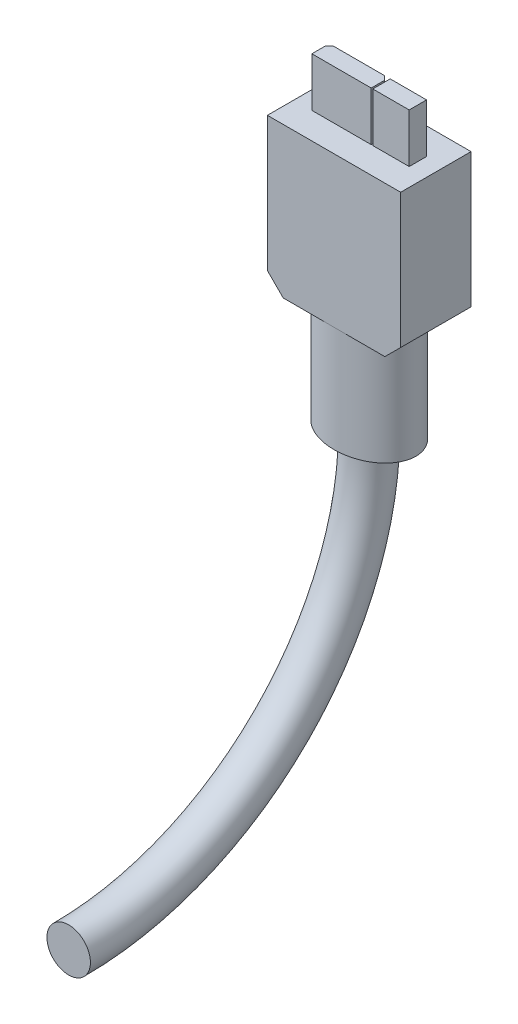
ISO-10303-21;
HEADER;
FILE_DESCRIPTION(('STEP AP214'),'2;1');
FILE_NAME('part.step','',(''),(''),'','','');
FILE_SCHEMA(('AUTOMOTIVE_DESIGN { 1 0 10303 214 1 1 1 1 }'));
ENDSEC;
DATA;
#1=APPLICATION_CONTEXT('core data for automotive mechanical design processes');
#2=APPLICATION_PROTOCOL_DEFINITION('international standard','automotive_design',2000,#1);
#3=PRODUCT_CONTEXT('',#1,'mechanical');
#4=PRODUCT('Part','Part','',(#3));
#5=PRODUCT_RELATED_PRODUCT_CATEGORY('part','',(#4));
#6=PRODUCT_DEFINITION_FORMATION('','',#4);
#7=PRODUCT_DEFINITION_CONTEXT('part definition',#1,'design');
#8=PRODUCT_DEFINITION('design','',#6,#7);
#9=PRODUCT_DEFINITION_SHAPE('','',#8);
#10=(LENGTH_UNIT() NAMED_UNIT(*) SI_UNIT(.MILLI.,.METRE.));
#11=(NAMED_UNIT(*) PLANE_ANGLE_UNIT() SI_UNIT($,.RADIAN.));
#12=(NAMED_UNIT(*) SI_UNIT($,.STERADIAN.) SOLID_ANGLE_UNIT());
#13=UNCERTAINTY_MEASURE_WITH_UNIT(LENGTH_MEASURE(1.E-05),#10,'distance_accuracy_value','');
#14=(GEOMETRIC_REPRESENTATION_CONTEXT(3) GLOBAL_UNCERTAINTY_ASSIGNED_CONTEXT((#13)) GLOBAL_UNIT_ASSIGNED_CONTEXT((#10,
#11,#12)) REPRESENTATION_CONTEXT('',''));
#15=CARTESIAN_POINT('',(0.,0.,0.));
#16=DIRECTION('',(0.,0.,1.));
#17=DIRECTION('',(1.,0.,0.));
#18=AXIS2_PLACEMENT_3D('',#15,#16,#17);
#19=CARTESIAN_POINT('',(0.,0.,0.));
#20=DIRECTION('',(0.,-1.,0.));
#21=DIRECTION('',(0.,0.,-1.));
#22=AXIS2_PLACEMENT_3D('',#19,#20,#21);
#23=PLANE('',#22);
#24=DIRECTION('',(-1.,0.,0.));
#25=VECTOR('',#24,1.);
#26=CARTESIAN_POINT('',(0.,0.,-8.9));
#27=LINE('',#26,#25);
#28=CARTESIAN_POINT('',(14.85,0.,-8.9));
#29=VERTEX_POINT('',#28);
#30=CARTESIAN_POINT('',(8.425,0.,-8.9));
#31=VERTEX_POINT('',#30);
#32=EDGE_CURVE('E158',#29,#31,#27,.T.);
#33=ORIENTED_EDGE('',*,*,#32,.F.);
#34=DIRECTION('',(0.,0.,1.));
#35=VECTOR('',#34,1.);
#36=CARTESIAN_POINT('',(14.85,0.,0.));
#37=LINE('',#36,#35);
#38=CARTESIAN_POINT('',(14.85,0.,0.));
#39=VERTEX_POINT('',#38);
#40=EDGE_CURVE('E293',#29,#39,#37,.T.);
#41=ORIENTED_EDGE('',*,*,#40,.T.);
#42=DIRECTION('',(1.,0.,0.));
#43=VECTOR('',#42,1.);
#44=CARTESIAN_POINT('',(0.,0.,0.));
#45=LINE('',#44,#43);
#46=CARTESIAN_POINT('',(8.425,0.,0.));
#47=VERTEX_POINT('',#46);
#48=EDGE_CURVE('E180',#47,#39,#45,.T.);
#49=ORIENTED_EDGE('',*,*,#48,.F.);
#50=CARTESIAN_POINT('',(8.425,0.,-4.45));
#51=DIRECTION('',(0.,-1.,0.));
#52=DIRECTION('',(-1.,0.,0.));
#53=AXIS2_PLACEMENT_3D('',#50,#51,#52);
#54=ELLIPSE('',#53,5.9,4.45);
#55=EDGE_CURVE('E178',#31,#47,#54,.T.);
#56=ORIENTED_EDGE('',*,*,#55,.F.);
#57=EDGE_LOOP('',(#33,#41,#49,#56));
#58=FACE_BOUND('',#57,.T.);
#59=ADVANCED_FACE('F37',(#58),#23,.T.);
#60=CARTESIAN_POINT('',(0.,19.,0.));
#61=DIRECTION('',(0.,-1.,0.));
#62=DIRECTION('',(0.,0.,-1.));
#63=AXIS2_PLACEMENT_3D('',#60,#61,#62);
#64=PLANE('',#63);
#65=DIRECTION('',(0.,0.,1.));
#66=VECTOR('',#65,1.);
#67=CARTESIAN_POINT('',(2.275,19.,-5.55));
#68=LINE('',#67,#66);
#69=CARTESIAN_POINT('',(2.275,19.,-5.05));
#70=VERTEX_POINT('',#69);
#71=CARTESIAN_POINT('',(2.275,19.,-3.35));
#72=VERTEX_POINT('',#71);
#73=EDGE_CURVE('E230',#70,#72,#68,.T.);
#74=ORIENTED_EDGE('',*,*,#73,.F.);
#75=DIRECTION('',(-0.70710678118655,0.,0.707106781186545));
#76=VECTOR('',#75,1.);
#77=CARTESIAN_POINT('',(-1.38750000000001,19.,-1.38750000000002));
#78=LINE('',#77,#76);
#79=CARTESIAN_POINT('',(2.775,19.,-5.55));
#80=VERTEX_POINT('',#79);
#81=EDGE_CURVE('E187',#70,#80,#78,.F.);
#82=ORIENTED_EDGE('',*,*,#81,.T.);
#83=DIRECTION('',(-1.,0.,0.));
#84=VECTOR('',#83,1.);
#85=CARTESIAN_POINT('',(2.275,19.,-5.55));
#86=LINE('',#85,#84);
#87=CARTESIAN_POINT('',(9.275,19.,-5.55));
#88=VERTEX_POINT('',#87);
#89=EDGE_CURVE('E234',#88,#80,#86,.T.);
#90=ORIENTED_EDGE('',*,*,#89,.F.);
#91=DIRECTION('',(-0.707106781186545,0.,-0.70710678118655));
#92=VECTOR('',#91,1.);
#93=CARTESIAN_POINT('',(7.41250000000003,19.,-7.41249999999998));
#94=LINE('',#93,#92);
#95=CARTESIAN_POINT('',(9.775,19.,-5.05));
#96=VERTEX_POINT('',#95);
#97=EDGE_CURVE('E191',#88,#96,#94,.F.);
#98=ORIENTED_EDGE('',*,*,#97,.T.);
#99=DIRECTION('',(0.,0.,-1.));
#100=VECTOR('',#99,1.);
#101=CARTESIAN_POINT('',(9.775,19.,-5.55));
#102=LINE('',#101,#100);
#103=CARTESIAN_POINT('',(9.775,19.,-3.35));
#104=VERTEX_POINT('',#103);
#105=EDGE_CURVE('E247',#104,#96,#102,.T.);
#106=ORIENTED_EDGE('',*,*,#105,.F.);
#107=DIRECTION('',(1.,0.,0.));
#108=VECTOR('',#107,1.);
#109=CARTESIAN_POINT('',(2.275,19.,-3.35));
#110=LINE('',#109,#108);
#111=EDGE_CURVE('E244',#72,#104,#110,.T.);
#112=ORIENTED_EDGE('',*,*,#111,.F.);
#113=EDGE_LOOP('',(#74,#82,#90,#98,#106,#112));
#114=FACE_BOUND('',#113,.T.);
#115=DIRECTION('',(0.,0.,1.));
#116=VECTOR('',#115,1.);
#117=CARTESIAN_POINT('',(0.,19.,0.));
#118=LINE('',#117,#116);
#119=CARTESIAN_POINT('',(0.,19.,-8.9));
#120=VERTEX_POINT('',#119);
#121=CARTESIAN_POINT('',(0.,19.,0.));
#122=VERTEX_POINT('',#121);
#123=EDGE_CURVE('E168',#120,#122,#118,.T.);
#124=ORIENTED_EDGE('',*,*,#123,.T.);
#125=DIRECTION('',(1.,0.,0.));
#126=VECTOR('',#125,1.);
#127=CARTESIAN_POINT('',(0.,19.,0.));
#128=LINE('',#127,#126);
#129=CARTESIAN_POINT('',(16.85,19.,0.));
#130=VERTEX_POINT('',#129);
#131=EDGE_CURVE('E259',#122,#130,#128,.T.);
#132=ORIENTED_EDGE('',*,*,#131,.T.);
#133=DIRECTION('',(0.,0.,-1.));
#134=VECTOR('',#133,1.);
#135=CARTESIAN_POINT('',(16.85,19.,0.));
#136=LINE('',#135,#134);
#137=CARTESIAN_POINT('',(16.85,19.,-8.9));
#138=VERTEX_POINT('',#137);
#139=EDGE_CURVE('E261',#130,#138,#136,.T.);
#140=ORIENTED_EDGE('',*,*,#139,.T.);
#141=DIRECTION('',(-1.,0.,0.));
#142=VECTOR('',#141,1.);
#143=CARTESIAN_POINT('',(0.,19.,-8.9));
#144=LINE('',#143,#142);
#145=EDGE_CURVE('E263',#138,#120,#144,.T.);
#146=ORIENTED_EDGE('',*,*,#145,.T.);
#147=EDGE_LOOP('',(#124,#132,#140,#146));
#148=FACE_BOUND('',#147,.T.);
#149=DIRECTION('',(1.,0.,0.));
#150=VECTOR('',#149,1.);
#151=CARTESIAN_POINT('',(14.575,19.,-3.35));
#152=LINE('',#151,#150);
#153=CARTESIAN_POINT('',(9.975,19.,-3.35));
#154=VERTEX_POINT('',#153);
#155=CARTESIAN_POINT('',(14.575,19.,-3.35));
#156=VERTEX_POINT('',#155);
#157=EDGE_CURVE('E208',#154,#156,#152,.T.);
#158=ORIENTED_EDGE('',*,*,#157,.F.);
#159=DIRECTION('',(0.,0.,1.));
#160=VECTOR('',#159,1.);
#161=CARTESIAN_POINT('',(9.975,19.,-3.35));
#162=LINE('',#161,#160);
#163=CARTESIAN_POINT('',(9.975,19.,-5.55));
#164=VERTEX_POINT('',#163);
#165=EDGE_CURVE('E201',#164,#154,#162,.T.);
#166=ORIENTED_EDGE('',*,*,#165,.F.);
#167=DIRECTION('',(-1.,0.,0.));
#168=VECTOR('',#167,1.);
#169=CARTESIAN_POINT('',(14.575,19.,-5.55));
#170=LINE('',#169,#168);
#171=CARTESIAN_POINT('',(14.575,19.,-5.55));
#172=VERTEX_POINT('',#171);
#173=EDGE_CURVE('E214',#172,#164,#170,.T.);
#174=ORIENTED_EDGE('',*,*,#173,.F.);
#175=DIRECTION('',(0.,0.,-1.));
#176=VECTOR('',#175,1.);
#177=CARTESIAN_POINT('',(14.575,19.,-5.55));
#178=LINE('',#177,#176);
#179=EDGE_CURVE('E211',#156,#172,#178,.T.);
#180=ORIENTED_EDGE('',*,*,#179,.F.);
#181=EDGE_LOOP('',(#158,#166,#174,#180));
#182=FACE_BOUND('',#181,.T.);
#183=ADVANCED_FACE('F307',(#114,#148,#182),#64,.F.);
#184=CARTESIAN_POINT('',(0.,19.,0.));
#185=DIRECTION('',(1.,0.,0.));
#186=DIRECTION('',(0.,0.,-1.));
#187=AXIS2_PLACEMENT_3D('',#184,#185,#186);
#188=PLANE('',#187);
#189=DIRECTION('',(0.,-1.,0.));
#190=VECTOR('',#189,1.);
#191=CARTESIAN_POINT('',(0.,19.,-8.9));
#192=LINE('',#191,#190);
#193=CARTESIAN_POINT('',(0.,1.99999999999999,-8.9));
#194=VERTEX_POINT('',#193);
#195=EDGE_CURVE('E265',#120,#194,#192,.T.);
#196=ORIENTED_EDGE('',*,*,#195,.T.);
#197=DIRECTION('',(0.,0.,1.));
#198=VECTOR('',#197,1.);
#199=CARTESIAN_POINT('',(0.,1.99999999999999,0.));
#200=LINE('',#199,#198);
#201=CARTESIAN_POINT('',(0.,1.99999999999999,0.));
#202=VERTEX_POINT('',#201);
#203=EDGE_CURVE('E297',#194,#202,#200,.T.);
#204=ORIENTED_EDGE('',*,*,#203,.T.);
#205=DIRECTION('',(0.,-1.,0.));
#206=VECTOR('',#205,1.);
#207=CARTESIAN_POINT('',(0.,19.,0.));
#208=LINE('',#207,#206);
#209=EDGE_CURVE('E274',#122,#202,#208,.T.);
#210=ORIENTED_EDGE('',*,*,#209,.F.);
#211=ORIENTED_EDGE('',*,*,#123,.F.);
#212=EDGE_LOOP('',(#196,#204,#210,#211));
#213=FACE_BOUND('',#212,.T.);
#214=ADVANCED_FACE('F300',(#213),#188,.F.);
#215=CARTESIAN_POINT('',(0.,19.,0.));
#216=DIRECTION('',(0.,0.,-1.));
#217=DIRECTION('',(-1.,0.,0.));
#218=AXIS2_PLACEMENT_3D('',#215,#216,#217);
#219=PLANE('',#218);
#220=ORIENTED_EDGE('',*,*,#48,.T.);
#221=DIRECTION('',(0.707106781186548,0.707106781186547,0.));
#222=VECTOR('',#221,1.);
#223=CARTESIAN_POINT('',(16.85,1.99999999999999,0.));
#224=LINE('',#223,#222);
#225=CARTESIAN_POINT('',(16.85,1.99999999999999,0.));
#226=VERTEX_POINT('',#225);
#227=EDGE_CURVE('E296',#39,#226,#224,.T.);
#228=ORIENTED_EDGE('',*,*,#227,.T.);
#229=DIRECTION('',(0.,-1.,0.));
#230=VECTOR('',#229,1.);
#231=CARTESIAN_POINT('',(16.85,19.,0.));
#232=LINE('',#231,#230);
#233=EDGE_CURVE('E271',#130,#226,#232,.T.);
#234=ORIENTED_EDGE('',*,*,#233,.F.);
#235=ORIENTED_EDGE('',*,*,#131,.F.);
#236=ORIENTED_EDGE('',*,*,#209,.T.);
#237=DIRECTION('',(0.707106781186549,-0.707106781186546,0.));
#238=VECTOR('',#237,1.);
#239=CARTESIAN_POINT('',(0.,1.99999999999999,0.));
#240=LINE('',#239,#238);
#241=CARTESIAN_POINT('',(2.,0.,0.));
#242=VERTEX_POINT('',#241);
#243=EDGE_CURVE('E54',#202,#242,#240,.T.);
#244=ORIENTED_EDGE('',*,*,#243,.T.);
#245=EDGE_CURVE('E176',#242,#47,#45,.T.);
#246=ORIENTED_EDGE('',*,*,#245,.T.);
#247=EDGE_LOOP('',(#220,#228,#234,#235,#236,#244,#246));
#248=FACE_BOUND('',#247,.T.);
#249=ADVANCED_FACE('F303',(#248),#219,.F.);
#250=CARTESIAN_POINT('',(16.85,19.,0.));
#251=DIRECTION('',(-1.,0.,0.));
#252=DIRECTION('',(0.,0.,1.));
#253=AXIS2_PLACEMENT_3D('',#250,#251,#252);
#254=PLANE('',#253);
#255=ORIENTED_EDGE('',*,*,#233,.T.);
#256=DIRECTION('',(0.,0.,-1.));
#257=VECTOR('',#256,1.);
#258=CARTESIAN_POINT('',(16.85,1.99999999999999,-8.9));
#259=LINE('',#258,#257);
#260=CARTESIAN_POINT('',(16.85,1.99999999999999,-8.9));
#261=VERTEX_POINT('',#260);
#262=EDGE_CURVE('E186',#226,#261,#259,.T.);
#263=ORIENTED_EDGE('',*,*,#262,.T.);
#264=DIRECTION('',(0.,-1.,0.));
#265=VECTOR('',#264,1.);
#266=CARTESIAN_POINT('',(16.85,19.,-8.9));
#267=LINE('',#266,#265);
#268=EDGE_CURVE('E269',#138,#261,#267,.T.);
#269=ORIENTED_EDGE('',*,*,#268,.F.);
#270=ORIENTED_EDGE('',*,*,#139,.F.);
#271=EDGE_LOOP('',(#255,#263,#269,#270));
#272=FACE_BOUND('',#271,.T.);
#273=ADVANCED_FACE('F346',(#272),#254,.F.);
#274=CARTESIAN_POINT('',(0.,19.,-8.9));
#275=DIRECTION('',(0.,0.,1.));
#276=DIRECTION('',(1.,0.,0.));
#277=AXIS2_PLACEMENT_3D('',#274,#275,#276);
#278=PLANE('',#277);
#279=ORIENTED_EDGE('',*,*,#268,.T.);
#280=DIRECTION('',(-0.707106781186548,-0.707106781186547,0.));
#281=VECTOR('',#280,1.);
#282=CARTESIAN_POINT('',(16.85,1.99999999999999,-8.9));
#283=LINE('',#282,#281);
#284=EDGE_CURVE('E164',#261,#29,#283,.T.);
#285=ORIENTED_EDGE('',*,*,#284,.T.);
#286=ORIENTED_EDGE('',*,*,#32,.T.);
#287=CARTESIAN_POINT('',(2.,0.,-8.9));
#288=VERTEX_POINT('',#287);
#289=EDGE_CURVE('E162',#31,#288,#27,.T.);
#290=ORIENTED_EDGE('',*,*,#289,.T.);
#291=DIRECTION('',(-0.707106781186549,0.707106781186546,0.));
#292=VECTOR('',#291,1.);
#293=CARTESIAN_POINT('',(0.,1.99999999999999,-8.9));
#294=LINE('',#293,#292);
#295=EDGE_CURVE('E189',#288,#194,#294,.T.);
#296=ORIENTED_EDGE('',*,*,#295,.T.);
#297=ORIENTED_EDGE('',*,*,#195,.F.);
#298=ORIENTED_EDGE('',*,*,#145,.F.);
#299=EDGE_LOOP('',(#279,#285,#286,#290,#296,#297,#298));
#300=FACE_BOUND('',#299,.T.);
#301=ADVANCED_FACE('F161',(#300),#278,.F.);
#302=ORIENTED_EDGE('',*,*,#245,.F.);
#303=DIRECTION('',(0.,0.,-1.));
#304=VECTOR('',#303,1.);
#305=CARTESIAN_POINT('',(2.,0.,-8.9));
#306=LINE('',#305,#304);
#307=EDGE_CURVE('E42',#242,#288,#306,.T.);
#308=ORIENTED_EDGE('',*,*,#307,.T.);
#309=ORIENTED_EDGE('',*,*,#289,.F.);
#310=EDGE_CURVE('E174',#47,#31,#54,.T.);
#311=ORIENTED_EDGE('',*,*,#310,.F.);
#312=EDGE_LOOP('',(#302,#308,#309,#311));
#313=FACE_BOUND('',#312,.T.);
#314=ADVANCED_FACE('F172',(#313),#23,.T.);
#315=CARTESIAN_POINT('',(2.275,25.2,-5.55));
#316=DIRECTION('',(1.,0.,0.));
#317=DIRECTION('',(0.,0.,-1.));
#318=AXIS2_PLACEMENT_3D('',#315,#316,#317);
#319=PLANE('',#318);
#320=DIRECTION('',(0.,0.,1.));
#321=VECTOR('',#320,1.);
#322=CARTESIAN_POINT('',(2.275,25.2,-5.55));
#323=LINE('',#322,#321);
#324=CARTESIAN_POINT('',(2.275,25.2,-5.05));
#325=VERTEX_POINT('',#324);
#326=CARTESIAN_POINT('',(2.275,25.2,-3.35));
#327=VERTEX_POINT('',#326);
#328=EDGE_CURVE('E231',#325,#327,#323,.T.);
#329=ORIENTED_EDGE('',*,*,#328,.F.);
#330=DIRECTION('',(0.,-1.,0.));
#331=VECTOR('',#330,1.);
#332=CARTESIAN_POINT('',(2.275,25.2,-5.05));
#333=LINE('',#332,#331);
#334=EDGE_CURVE('E287',#325,#70,#333,.T.);
#335=ORIENTED_EDGE('',*,*,#334,.T.);
#336=ORIENTED_EDGE('',*,*,#73,.T.);
#337=DIRECTION('',(0.,-1.,0.));
#338=VECTOR('',#337,1.);
#339=CARTESIAN_POINT('',(2.275,25.2,-3.35));
#340=LINE('',#339,#338);
#341=EDGE_CURVE('E254',#327,#72,#340,.T.);
#342=ORIENTED_EDGE('',*,*,#341,.F.);
#343=EDGE_LOOP('',(#329,#335,#336,#342));
#344=FACE_BOUND('',#343,.T.);
#345=ADVANCED_FACE('F337',(#344),#319,.F.);
#346=CARTESIAN_POINT('',(2.275,25.2,-3.35));
#347=DIRECTION('',(0.,0.,-1.));
#348=DIRECTION('',(-1.,0.,0.));
#349=AXIS2_PLACEMENT_3D('',#346,#347,#348);
#350=PLANE('',#349);
#351=ORIENTED_EDGE('',*,*,#111,.T.);
#352=DIRECTION('',(0.,-1.,0.));
#353=VECTOR('',#352,1.);
#354=CARTESIAN_POINT('',(9.775,25.2,-3.35));
#355=LINE('',#354,#353);
#356=CARTESIAN_POINT('',(9.775,25.2,-3.35));
#357=VERTEX_POINT('',#356);
#358=EDGE_CURVE('E242',#357,#104,#355,.T.);
#359=ORIENTED_EDGE('',*,*,#358,.F.);
#360=DIRECTION('',(1.,0.,0.));
#361=VECTOR('',#360,1.);
#362=CARTESIAN_POINT('',(2.275,25.2,-3.35));
#363=LINE('',#362,#361);
#364=EDGE_CURVE('E233',#327,#357,#363,.T.);
#365=ORIENTED_EDGE('',*,*,#364,.F.);
#366=ORIENTED_EDGE('',*,*,#341,.T.);
#367=EDGE_LOOP('',(#351,#359,#365,#366));
#368=FACE_BOUND('',#367,.T.);
#369=ADVANCED_FACE('F343',(#368),#350,.F.);
#370=CARTESIAN_POINT('',(9.775,25.2,-5.55));
#371=DIRECTION('',(-1.,0.,0.));
#372=DIRECTION('',(0.,0.,1.));
#373=AXIS2_PLACEMENT_3D('',#370,#371,#372);
#374=PLANE('',#373);
#375=ORIENTED_EDGE('',*,*,#105,.T.);
#376=DIRECTION('',(0.,1.,0.));
#377=VECTOR('',#376,1.);
#378=CARTESIAN_POINT('',(9.775,25.2,-5.05));
#379=LINE('',#378,#377);
#380=CARTESIAN_POINT('',(9.775,25.2,-5.05));
#381=VERTEX_POINT('',#380);
#382=EDGE_CURVE('E281',#96,#381,#379,.T.);
#383=ORIENTED_EDGE('',*,*,#382,.T.);
#384=DIRECTION('',(0.,0.,-1.));
#385=VECTOR('',#384,1.);
#386=CARTESIAN_POINT('',(9.775,25.2,-5.55));
#387=LINE('',#386,#385);
#388=EDGE_CURVE('E236',#357,#381,#387,.T.);
#389=ORIENTED_EDGE('',*,*,#388,.F.);
#390=ORIENTED_EDGE('',*,*,#358,.T.);
#391=EDGE_LOOP('',(#375,#383,#389,#390));
#392=FACE_BOUND('',#391,.T.);
#393=ADVANCED_FACE('F402',(#392),#374,.F.);
#394=CARTESIAN_POINT('',(2.275,25.2,-5.55));
#395=DIRECTION('',(0.,0.,1.));
#396=DIRECTION('',(1.,0.,0.));
#397=AXIS2_PLACEMENT_3D('',#394,#395,#396);
#398=PLANE('',#397);
#399=DIRECTION('',(-1.,0.,0.));
#400=VECTOR('',#399,1.);
#401=CARTESIAN_POINT('',(2.275,25.2,-5.55));
#402=LINE('',#401,#400);
#403=CARTESIAN_POINT('',(9.275,25.2,-5.55));
#404=VERTEX_POINT('',#403);
#405=CARTESIAN_POINT('',(2.775,25.2,-5.55));
#406=VERTEX_POINT('',#405);
#407=EDGE_CURVE('E239',#404,#406,#402,.T.);
#408=ORIENTED_EDGE('',*,*,#407,.F.);
#409=DIRECTION('',(0.,-1.,0.));
#410=VECTOR('',#409,1.);
#411=CARTESIAN_POINT('',(9.275,25.2,-5.55));
#412=LINE('',#411,#410);
#413=EDGE_CURVE('E278',#404,#88,#412,.T.);
#414=ORIENTED_EDGE('',*,*,#413,.T.);
#415=ORIENTED_EDGE('',*,*,#89,.T.);
#416=DIRECTION('',(0.,1.,0.));
#417=VECTOR('',#416,1.);
#418=CARTESIAN_POINT('',(2.775,25.2,-5.55));
#419=LINE('',#418,#417);
#420=EDGE_CURVE('E276',#80,#406,#419,.T.);
#421=ORIENTED_EDGE('',*,*,#420,.T.);
#422=EDGE_LOOP('',(#408,#414,#415,#421));
#423=FACE_BOUND('',#422,.T.);
#424=ADVANCED_FACE('F401',(#423),#398,.F.);
#425=CARTESIAN_POINT('',(0.,25.2,0.));
#426=DIRECTION('',(0.,1.,0.));
#427=DIRECTION('',(0.,0.,1.));
#428=AXIS2_PLACEMENT_3D('',#425,#426,#427);
#429=PLANE('',#428);
#430=ORIENTED_EDGE('',*,*,#388,.T.);
#431=DIRECTION('',(0.707106781186545,0.,0.70710678118655));
#432=VECTOR('',#431,1.);
#433=CARTESIAN_POINT('',(7.41250000000003,25.2,-7.41249999999998));
#434=LINE('',#433,#432);
#435=EDGE_CURVE('E285',#381,#404,#434,.F.);
#436=ORIENTED_EDGE('',*,*,#435,.T.);
#437=ORIENTED_EDGE('',*,*,#407,.T.);
#438=DIRECTION('',(0.70710678118655,0.,-0.707106781186545));
#439=VECTOR('',#438,1.);
#440=CARTESIAN_POINT('',(-1.38750000000001,25.2,-1.38750000000002));
#441=LINE('',#440,#439);
#442=EDGE_CURVE('E283',#406,#325,#441,.F.);
#443=ORIENTED_EDGE('',*,*,#442,.T.);
#444=ORIENTED_EDGE('',*,*,#328,.T.);
#445=ORIENTED_EDGE('',*,*,#364,.T.);
#446=EDGE_LOOP('',(#430,#436,#437,#443,#444,#445));
#447=FACE_BOUND('',#446,.T.);
#448=ADVANCED_FACE('F386',(#447),#429,.T.);
#449=CARTESIAN_POINT('',(14.575,25.2,-3.35));
#450=DIRECTION('',(0.,0.,-1.));
#451=DIRECTION('',(-1.,0.,0.));
#452=AXIS2_PLACEMENT_3D('',#449,#450,#451);
#453=PLANE('',#452);
#454=ORIENTED_EDGE('',*,*,#157,.T.);
#455=DIRECTION('',(0.,-1.,0.));
#456=VECTOR('',#455,1.);
#457=CARTESIAN_POINT('',(14.575,25.2,-3.35));
#458=LINE('',#457,#456);
#459=CARTESIAN_POINT('',(14.575,25.2,-3.35));
#460=VERTEX_POINT('',#459);
#461=EDGE_CURVE('E227',#460,#156,#458,.T.);
#462=ORIENTED_EDGE('',*,*,#461,.F.);
#463=DIRECTION('',(1.,0.,0.));
#464=VECTOR('',#463,1.);
#465=CARTESIAN_POINT('',(14.575,25.2,-3.35));
#466=LINE('',#465,#464);
#467=CARTESIAN_POINT('',(9.975,25.2,-3.35));
#468=VERTEX_POINT('',#467);
#469=EDGE_CURVE('E197',#468,#460,#466,.T.);
#470=ORIENTED_EDGE('',*,*,#469,.F.);
#471=DIRECTION('',(0.,-1.,0.));
#472=VECTOR('',#471,1.);
#473=CARTESIAN_POINT('',(9.975,25.2,-3.35));
#474=LINE('',#473,#472);
#475=EDGE_CURVE('E207',#468,#154,#474,.T.);
#476=ORIENTED_EDGE('',*,*,#475,.T.);
#477=EDGE_LOOP('',(#454,#462,#470,#476));
#478=FACE_BOUND('',#477,.T.);
#479=ADVANCED_FACE('F414',(#478),#453,.F.);
#480=CARTESIAN_POINT('',(14.575,25.2,-5.55));
#481=DIRECTION('',(-1.,0.,0.));
#482=DIRECTION('',(0.,0.,1.));
#483=AXIS2_PLACEMENT_3D('',#480,#481,#482);
#484=PLANE('',#483);
#485=ORIENTED_EDGE('',*,*,#179,.T.);
#486=DIRECTION('',(0.,-1.,0.));
#487=VECTOR('',#486,1.);
#488=CARTESIAN_POINT('',(14.575,25.2,-5.55));
#489=LINE('',#488,#487);
#490=CARTESIAN_POINT('',(14.575,25.2,-5.55));
#491=VERTEX_POINT('',#490);
#492=EDGE_CURVE('E224',#491,#172,#489,.T.);
#493=ORIENTED_EDGE('',*,*,#492,.F.);
#494=DIRECTION('',(0.,0.,-1.));
#495=VECTOR('',#494,1.);
#496=CARTESIAN_POINT('',(14.575,25.2,-5.55));
#497=LINE('',#496,#495);
#498=EDGE_CURVE('E200',#460,#491,#497,.T.);
#499=ORIENTED_EDGE('',*,*,#498,.F.);
#500=ORIENTED_EDGE('',*,*,#461,.T.);
#501=EDGE_LOOP('',(#485,#493,#499,#500));
#502=FACE_BOUND('',#501,.T.);
#503=ADVANCED_FACE('F417',(#502),#484,.F.);
#504=CARTESIAN_POINT('',(14.575,25.2,-5.55));
#505=DIRECTION('',(0.,0.,1.));
#506=DIRECTION('',(1.,0.,0.));
#507=AXIS2_PLACEMENT_3D('',#504,#505,#506);
#508=PLANE('',#507);
#509=ORIENTED_EDGE('',*,*,#173,.T.);
#510=DIRECTION('',(0.,-1.,0.));
#511=VECTOR('',#510,1.);
#512=CARTESIAN_POINT('',(9.975,25.2,-5.55));
#513=LINE('',#512,#511);
#514=CARTESIAN_POINT('',(9.975,25.2,-5.55));
#515=VERTEX_POINT('',#514);
#516=EDGE_CURVE('E221',#515,#164,#513,.T.);
#517=ORIENTED_EDGE('',*,*,#516,.F.);
#518=DIRECTION('',(-1.,0.,0.));
#519=VECTOR('',#518,1.);
#520=CARTESIAN_POINT('',(14.575,25.2,-5.55));
#521=LINE('',#520,#519);
#522=EDGE_CURVE('E203',#491,#515,#521,.T.);
#523=ORIENTED_EDGE('',*,*,#522,.F.);
#524=ORIENTED_EDGE('',*,*,#492,.T.);
#525=EDGE_LOOP('',(#509,#517,#523,#524));
#526=FACE_BOUND('',#525,.T.);
#527=ADVANCED_FACE('F421',(#526),#508,.F.);
#528=CARTESIAN_POINT('',(9.975,25.2,-3.35));
#529=DIRECTION('',(1.,0.,0.));
#530=DIRECTION('',(0.,0.,-1.));
#531=AXIS2_PLACEMENT_3D('',#528,#529,#530);
#532=PLANE('',#531);
#533=ORIENTED_EDGE('',*,*,#165,.T.);
#534=ORIENTED_EDGE('',*,*,#475,.F.);
#535=DIRECTION('',(0.,0.,1.));
#536=VECTOR('',#535,1.);
#537=CARTESIAN_POINT('',(9.975,25.2,-3.35));
#538=LINE('',#537,#536);
#539=EDGE_CURVE('E205',#515,#468,#538,.T.);
#540=ORIENTED_EDGE('',*,*,#539,.F.);
#541=ORIENTED_EDGE('',*,*,#516,.T.);
#542=EDGE_LOOP('',(#533,#534,#540,#541));
#543=FACE_BOUND('',#542,.T.);
#544=ADVANCED_FACE('F425',(#543),#532,.F.);
#545=CARTESIAN_POINT('',(0.,25.2,0.));
#546=DIRECTION('',(0.,-1.,0.));
#547=DIRECTION('',(0.,0.,-1.));
#548=AXIS2_PLACEMENT_3D('',#545,#546,#547);
#549=PLANE('',#548);
#550=ORIENTED_EDGE('',*,*,#469,.T.);
#551=ORIENTED_EDGE('',*,*,#498,.T.);
#552=ORIENTED_EDGE('',*,*,#522,.T.);
#553=ORIENTED_EDGE('',*,*,#539,.T.);
#554=EDGE_LOOP('',(#550,#551,#552,#553));
#555=FACE_BOUND('',#554,.T.);
#556=ADVANCED_FACE('F364',(#555),#549,.F.);
#557=CARTESIAN_POINT('',(9.275,25.2,-5.55));
#558=DIRECTION('',(-0.70710678118655,0.,0.707106781186545));
#559=DIRECTION('',(0.,-1.,0.));
#560=AXIS2_PLACEMENT_3D('',#557,#558,#559);
#561=PLANE('',#560);
#562=ORIENTED_EDGE('',*,*,#435,.F.);
#563=ORIENTED_EDGE('',*,*,#382,.F.);
#564=ORIENTED_EDGE('',*,*,#97,.F.);
#565=ORIENTED_EDGE('',*,*,#413,.F.);
#566=EDGE_LOOP('',(#562,#563,#564,#565));
#567=FACE_BOUND('',#566,.T.);
#568=ADVANCED_FACE('F357',(#567),#561,.F.);
#569=CARTESIAN_POINT('',(2.275,25.2,-5.05));
#570=DIRECTION('',(0.707106781186545,0.,0.70710678118655));
#571=DIRECTION('',(0.,-1.,0.));
#572=AXIS2_PLACEMENT_3D('',#569,#570,#571);
#573=PLANE('',#572);
#574=ORIENTED_EDGE('',*,*,#442,.F.);
#575=ORIENTED_EDGE('',*,*,#420,.F.);
#576=ORIENTED_EDGE('',*,*,#81,.F.);
#577=ORIENTED_EDGE('',*,*,#334,.F.);
#578=EDGE_LOOP('',(#574,#575,#576,#577));
#579=FACE_BOUND('',#578,.T.);
#580=ADVANCED_FACE('F363',(#579),#573,.F.);
#581=CARTESIAN_POINT('',(8.425,-13.4,-4.45));
#582=DIRECTION('',(0.,-1.,0.));
#583=DIRECTION('',(-1.,0.,0.));
#584=AXIS2_PLACEMENT_3D('',#581,#582,#583);
#585=ELLIPSE('',#584,5.9,4.45);
#586=DIRECTION('',(0.,1.,0.));
#587=VECTOR('',#586,1.);
#588=SURFACE_OF_LINEAR_EXTRUSION('',#585,#587);
#589=CARTESIAN_POINT('',(2.525,-13.4,-4.45));
#590=VERTEX_POINT('',#589);
#591=EDGE_CURVE('E182',#590,#590,#585,.T.);
#592=ORIENTED_EDGE('',*,*,#591,.F.);
#593=EDGE_LOOP('',(#592));
#594=FACE_BOUND('',#593,.T.);
#595=ORIENTED_EDGE('',*,*,#55,.T.);
#596=ORIENTED_EDGE('',*,*,#310,.T.);
#597=EDGE_LOOP('',(#595,#596));
#598=FACE_BOUND('',#597,.T.);
#599=ADVANCED_FACE('F185',(#594,#598),#588,.F.);
#600=CARTESIAN_POINT('',(8.425,-13.4,-4.45));
#601=DIRECTION('',(0.,-1.,0.));
#602=DIRECTION('',(0.,0.,-1.));
#603=AXIS2_PLACEMENT_3D('',#600,#601,#602);
#604=PLANE('',#603);
#605=CARTESIAN_POINT('',(8.425,-13.4,-4.45));
#606=DIRECTION('',(0.,-1.,0.));
#607=DIRECTION('',(0.,0.,-1.));
#608=AXIS2_PLACEMENT_3D('',#605,#606,#607);
#609=CIRCLE('',#608,2.75);
#610=CARTESIAN_POINT('',(8.425,-13.4,-7.19999999999999));
#611=VERTEX_POINT('',#610);
#612=EDGE_CURVE('E11',#611,#611,#609,.T.);
#613=ORIENTED_EDGE('',*,*,#612,.F.);
#614=EDGE_LOOP('',(#613));
#615=FACE_BOUND('',#614,.T.);
#616=ORIENTED_EDGE('',*,*,#591,.T.);
#617=EDGE_LOOP('',(#616));
#618=FACE_BOUND('',#617,.T.);
#619=ADVANCED_FACE('F321',(#615,#618),#604,.T.);
#620=CARTESIAN_POINT('',(16.85,1.99999999999999,0.));
#621=DIRECTION('',(0.707106781186547,-0.707106781186548,0.));
#622=DIRECTION('',(0.,0.,1.));
#623=AXIS2_PLACEMENT_3D('',#620,#621,#622);
#624=PLANE('',#623);
#625=ORIENTED_EDGE('',*,*,#227,.F.);
#626=ORIENTED_EDGE('',*,*,#40,.F.);
#627=ORIENTED_EDGE('',*,*,#284,.F.);
#628=ORIENTED_EDGE('',*,*,#262,.F.);
#629=EDGE_LOOP('',(#625,#626,#627,#628));
#630=FACE_BOUND('',#629,.T.);
#631=ADVANCED_FACE('F313',(#630),#624,.T.);
#632=CARTESIAN_POINT('',(0.,1.99999999999999,0.));
#633=DIRECTION('',(-0.707106781186546,-0.707106781186549,0.));
#634=DIRECTION('',(0.,0.,-1.));
#635=AXIS2_PLACEMENT_3D('',#632,#633,#634);
#636=PLANE('',#635);
#637=ORIENTED_EDGE('',*,*,#295,.F.);
#638=ORIENTED_EDGE('',*,*,#307,.F.);
#639=ORIENTED_EDGE('',*,*,#243,.F.);
#640=ORIENTED_EDGE('',*,*,#203,.F.);
#641=EDGE_LOOP('',(#637,#638,#639,#640));
#642=FACE_BOUND('',#641,.T.);
#643=ADVANCED_FACE('F40',(#642),#636,.T.);
#644=CARTESIAN_POINT('',(8.425,-51.4,33.55));
#645=DIRECTION('',(0.,0.,1.));
#646=DIRECTION('',(0.,-1.,0.));
#647=AXIS2_PLACEMENT_3D('',#644,#645,#646);
#648=PLANE('',#647);
#649=CARTESIAN_POINT('',(8.425,-51.4,33.55));
#650=DIRECTION('',(0.,0.,1.));
#651=DIRECTION('',(0.,-1.,0.));
#652=AXIS2_PLACEMENT_3D('',#649,#650,#651);
#653=CIRCLE('',#652,2.75);
#654=CARTESIAN_POINT('',(8.425,-54.15,33.55));
#655=VERTEX_POINT('',#654);
#656=EDGE_CURVE('E183',#655,#655,#653,.T.);
#657=ORIENTED_EDGE('',*,*,#656,.T.);
#658=EDGE_LOOP('',(#657));
#659=FACE_BOUND('',#658,.T.);
#660=ADVANCED_FACE('F312',(#659),#648,.T.);
#661=CARTESIAN_POINT('',(8.425,-13.4,33.55));
#662=DIRECTION('',(-1.,0.,0.));
#663=DIRECTION('',(0.,0.,1.));
#664=AXIS2_PLACEMENT_3D('',#661,#662,#663);
#665=TOROIDAL_SURFACE('',#664,38.,2.75);
#666=CARTESIAN_POINT('',(8.425,-13.4,33.55));
#667=DIRECTION('',(-1.,0.,0.));
#668=DIRECTION('',(0.,0.,1.));
#669=AXIS2_PLACEMENT_3D('',#666,#667,#668);
#670=CIRCLE('',#669,40.75);
#671=EDGE_CURVE('',#611,#655,#670,.T.);
#672=ORIENTED_EDGE('',*,*,#612,.T.);
#673=ORIENTED_EDGE('',*,*,#656,.F.);
#674=ORIENTED_EDGE('',*,*,#671,.T.);
#675=ORIENTED_EDGE('',*,*,#671,.F.);
#676=EDGE_LOOP('',(#672,#674,#673,#675));
#677=FACE_BOUND('',#676,.T.);
#678=ADVANCED_FACE('F314',(#677),#665,.T.);
#679=CLOSED_SHELL('',(#59,#183,#214,#249,#273,#301,#314,#345,#369,#393,#424,#448,#479,#503,#527,
#544,#556,#568,#580,#599,#619,#631,#643,#660,#678));
#680=MANIFOLD_SOLID_BREP('B2',#679);
#681=ADVANCED_BREP_SHAPE_REPRESENTATION('',(#18,#680),#14);
#682=SHAPE_DEFINITION_REPRESENTATION(#9,#681);
ENDSEC;
END-ISO-10303-21;
